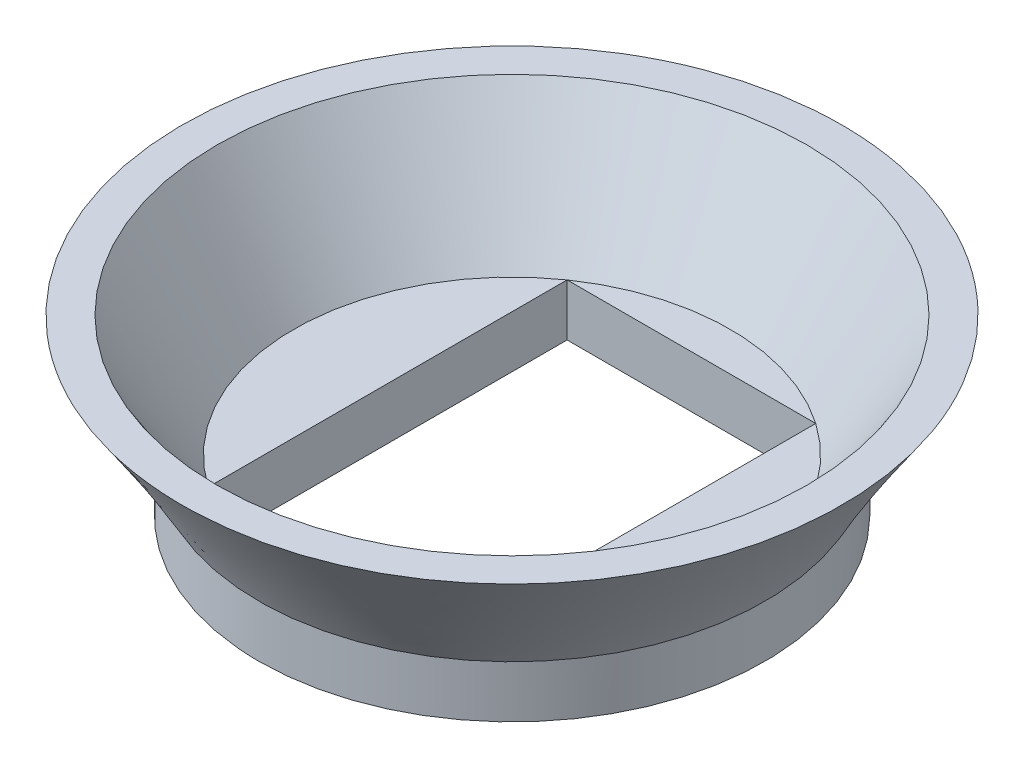
ISO-10303-21;
HEADER;
FILE_DESCRIPTION(('STEP AP214'),'2;1');
FILE_NAME('part.step','',(''),(''),'','','');
FILE_SCHEMA(('AUTOMOTIVE_DESIGN { 1 0 10303 214 1 1 1 1 }'));
ENDSEC;
DATA;
#1=APPLICATION_CONTEXT('core data for automotive mechanical design processes');
#2=APPLICATION_PROTOCOL_DEFINITION('international standard','automotive_design',2000,#1);
#3=PRODUCT_CONTEXT('',#1,'mechanical');
#4=PRODUCT('Part','Part','',(#3));
#5=PRODUCT_RELATED_PRODUCT_CATEGORY('part','',(#4));
#6=PRODUCT_DEFINITION_FORMATION('','',#4);
#7=PRODUCT_DEFINITION_CONTEXT('part definition',#1,'design');
#8=PRODUCT_DEFINITION('design','',#6,#7);
#9=PRODUCT_DEFINITION_SHAPE('','',#8);
#10=(LENGTH_UNIT() NAMED_UNIT(*) SI_UNIT(.MILLI.,.METRE.));
#11=(NAMED_UNIT(*) PLANE_ANGLE_UNIT() SI_UNIT($,.RADIAN.));
#12=(NAMED_UNIT(*) SI_UNIT($,.STERADIAN.) SOLID_ANGLE_UNIT());
#13=UNCERTAINTY_MEASURE_WITH_UNIT(LENGTH_MEASURE(1.E-05),#10,'distance_accuracy_value','');
#14=(GEOMETRIC_REPRESENTATION_CONTEXT(3) GLOBAL_UNCERTAINTY_ASSIGNED_CONTEXT((#13)) GLOBAL_UNIT_ASSIGNED_CONTEXT((#10,
#11,#12)) REPRESENTATION_CONTEXT('',''));
#15=CARTESIAN_POINT('',(0.,0.,0.));
#16=DIRECTION('',(0.,0.,1.));
#17=DIRECTION('',(1.,0.,0.));
#18=AXIS2_PLACEMENT_3D('',#15,#16,#17);
#19=CARTESIAN_POINT('',(0.,1.8,0.));
#20=DIRECTION('',(0.,1.,0.));
#21=DIRECTION('',(0.,0.,1.));
#22=AXIS2_PLACEMENT_3D('',#19,#20,#21);
#23=PLANE('',#22);
#24=DIRECTION('',(0.,0.,1.));
#25=VECTOR('',#24,1.);
#26=CARTESIAN_POINT('',(-4.3,1.8,-6.2058440199541));
#27=LINE('',#26,#25);
#28=CARTESIAN_POINT('',(-4.3,1.8,-6.2058440199541));
#29=VERTEX_POINT('',#28);
#30=CARTESIAN_POINT('',(-4.3,1.8,6.2058440199541));
#31=VERTEX_POINT('',#30);
#32=EDGE_CURVE('E98',#29,#31,#27,.T.);
#33=ORIENTED_EDGE('',*,*,#32,.F.);
#34=CARTESIAN_POINT('',(0.,1.8,0.));
#35=DIRECTION('',(0.,1.,0.));
#36=DIRECTION('',(0.,0.,1.));
#37=AXIS2_PLACEMENT_3D('',#34,#35,#36);
#38=CIRCLE('',#37,7.55);
#39=EDGE_CURVE('E140',#29,#31,#38,.T.);
#40=ORIENTED_EDGE('',*,*,#39,.T.);
#41=EDGE_LOOP('',(#33,#40));
#42=FACE_BOUND('',#41,.T.);
#43=ADVANCED_FACE('F47',(#42),#23,.T.);
#44=DIRECTION('',(1.,0.,0.));
#45=VECTOR('',#44,1.);
#46=CARTESIAN_POINT('',(4.3,1.8,6.2058440199541));
#47=LINE('',#46,#45);
#48=CARTESIAN_POINT('',(4.3,1.8,6.2058440199541));
#49=VERTEX_POINT('',#48);
#50=EDGE_CURVE('E134',#31,#49,#47,.T.);
#51=ORIENTED_EDGE('',*,*,#50,.F.);
#52=EDGE_CURVE('E157',#31,#49,#38,.T.);
#53=ORIENTED_EDGE('',*,*,#52,.T.);
#54=EDGE_LOOP('',(#51,#53));
#55=FACE_BOUND('',#54,.T.);
#56=ADVANCED_FACE('F265',(#55),#23,.T.);
#57=DIRECTION('',(0.,0.,-1.));
#58=VECTOR('',#57,1.);
#59=CARTESIAN_POINT('',(4.3,1.8,-6.2058440199541));
#60=LINE('',#59,#58);
#61=CARTESIAN_POINT('',(4.30000438472517,1.8,-6.20584279493454));
#62=VERTEX_POINT('',#61);
#63=EDGE_CURVE('E66',#49,#62,#60,.T.);
#64=ORIENTED_EDGE('',*,*,#63,.F.);
#65=EDGE_CURVE('E51',#49,#62,#38,.T.);
#66=ORIENTED_EDGE('',*,*,#65,.T.);
#67=EDGE_LOOP('',(#64,#66));
#68=FACE_BOUND('',#67,.T.);
#69=ADVANCED_FACE('F219',(#68),#23,.T.);
#70=CARTESIAN_POINT('',(0.,1.8,0.));
#71=DIRECTION('',(0.,-1.,0.));
#72=DIRECTION('',(0.,0.,-1.));
#73=AXIS2_PLACEMENT_3D('',#70,#71,#72);
#74=CYLINDRICAL_SURFACE('',#73,8.75);
#75=CARTESIAN_POINT('',(0.,1.8,0.));
#76=DIRECTION('',(0.,-1.,0.));
#77=DIRECTION('',(0.,0.,-1.));
#78=AXIS2_PLACEMENT_3D('',#75,#76,#77);
#79=CIRCLE('',#78,8.75);
#80=CARTESIAN_POINT('',(-0.757744304662549,1.8,8.7171281720961));
#81=VERTEX_POINT('',#80);
#82=EDGE_CURVE('E12',#81,#81,#79,.F.);
#83=ORIENTED_EDGE('',*,*,#82,.F.);
#84=EDGE_LOOP('',(#83));
#85=FACE_BOUND('',#84,.T.);
#86=CARTESIAN_POINT('',(0.,0.,0.));
#87=DIRECTION('',(0.,1.,0.));
#88=DIRECTION('',(0.,0.,1.));
#89=AXIS2_PLACEMENT_3D('',#86,#87,#88);
#90=CIRCLE('',#89,8.75);
#91=CARTESIAN_POINT('',(0.,0.,8.75));
#92=VERTEX_POINT('',#91);
#93=EDGE_CURVE('E58',#92,#92,#90,.T.);
#94=ORIENTED_EDGE('',*,*,#93,.T.);
#95=EDGE_LOOP('',(#94));
#96=FACE_BOUND('',#95,.T.);
#97=ADVANCED_FACE('F49',(#85,#96),#74,.T.);
#98=CARTESIAN_POINT('',(0.,0.,0.));
#99=DIRECTION('',(0.,1.,0.));
#100=DIRECTION('',(0.,0.,1.));
#101=AXIS2_PLACEMENT_3D('',#98,#99,#100);
#102=PLANE('',#101);
#103=DIRECTION('',(-1.,0.,0.));
#104=VECTOR('',#103,1.);
#105=CARTESIAN_POINT('',(4.3,0.,-6.2058440199541));
#106=LINE('',#105,#104);
#107=CARTESIAN_POINT('',(4.3,0.,-6.2058440199541));
#108=VERTEX_POINT('',#107);
#109=CARTESIAN_POINT('',(-4.3,0.,-6.2058440199541));
#110=VERTEX_POINT('',#109);
#111=EDGE_CURVE('E104',#108,#110,#106,.T.);
#112=ORIENTED_EDGE('',*,*,#111,.T.);
#113=DIRECTION('',(0.,0.,1.));
#114=VECTOR('',#113,1.);
#115=CARTESIAN_POINT('',(-4.3,0.,-6.2058440199541));
#116=LINE('',#115,#114);
#117=CARTESIAN_POINT('',(-4.3,0.,6.2058440199541));
#118=VERTEX_POINT('',#117);
#119=EDGE_CURVE('E95',#110,#118,#116,.T.);
#120=ORIENTED_EDGE('',*,*,#119,.T.);
#121=DIRECTION('',(1.,0.,0.));
#122=VECTOR('',#121,1.);
#123=CARTESIAN_POINT('',(4.3,0.,6.2058440199541));
#124=LINE('',#123,#122);
#125=CARTESIAN_POINT('',(4.3,0.,6.2058440199541));
#126=VERTEX_POINT('',#125);
#127=EDGE_CURVE('E107',#118,#126,#124,.T.);
#128=ORIENTED_EDGE('',*,*,#127,.T.);
#129=DIRECTION('',(0.,0.,-1.));
#130=VECTOR('',#129,1.);
#131=CARTESIAN_POINT('',(4.3,0.,-6.2058440199541));
#132=LINE('',#131,#130);
#133=EDGE_CURVE('E71',#126,#108,#132,.T.);
#134=ORIENTED_EDGE('',*,*,#133,.T.);
#135=EDGE_LOOP('',(#112,#120,#128,#134));
#136=FACE_BOUND('',#135,.T.);
#137=ORIENTED_EDGE('',*,*,#93,.F.);
#138=EDGE_LOOP('',(#137));
#139=FACE_BOUND('',#138,.T.);
#140=ADVANCED_FACE('F112',(#136,#139),#102,.F.);
#141=CARTESIAN_POINT('',(0.,6.,0.));
#142=DIRECTION('',(0.,1.,0.));
#143=DIRECTION('',(0.,0.,1.));
#144=AXIS2_PLACEMENT_3D('',#141,#142,#143);
#145=PLANE('',#144);
#146=CARTESIAN_POINT('',(0.,6.,0.));
#147=DIRECTION('',(0.,1.,0.));
#148=DIRECTION('',(0.,0.,1.));
#149=AXIS2_PLACEMENT_3D('',#146,#147,#148);
#150=CIRCLE('',#149,10.2);
#151=CARTESIAN_POINT('',(0.,6.,10.2));
#152=VERTEX_POINT('',#151);
#153=EDGE_CURVE('E149',#152,#152,#150,.T.);
#154=ORIENTED_EDGE('',*,*,#153,.F.);
#155=EDGE_LOOP('',(#154));
#156=FACE_BOUND('',#155,.T.);
#157=CARTESIAN_POINT('',(0.,6.,0.));
#158=DIRECTION('',(0.,1.,0.));
#159=DIRECTION('',(0.,0.,1.));
#160=AXIS2_PLACEMENT_3D('',#157,#158,#159);
#161=CIRCLE('',#160,11.4);
#162=CARTESIAN_POINT('',(-3.81439950139794,6.,10.7429212248687));
#163=VERTEX_POINT('',#162);
#164=EDGE_CURVE('E222',#163,#163,#161,.T.);
#165=ORIENTED_EDGE('',*,*,#164,.T.);
#166=EDGE_LOOP('',(#165));
#167=FACE_BOUND('',#166,.T.);
#168=ADVANCED_FACE('F248',(#156,#167),#145,.T.);
#169=CARTESIAN_POINT('',(-0.757744304662549,1.8,8.7171281720961));
#170=CARTESIAN_POINT('',(-3.81439950139794,6.,10.7429212248687));
#171=CARTESIAN_POINT('',(16.6765120395296,1.8,10.2326167814212));
#172=CARTESIAN_POINT('',(17.6714429483395,6.,18.3717202276646));
#173=CARTESIAN_POINT('',(18.1920006488547,1.8,-7.20163956277101));
#174=CARTESIAN_POINT('',(25.3002419511354,6.,-3.11412222207286));
#175=CARTESIAN_POINT('',(0.757744304662548,1.8,-8.7171281720961));
#176=CARTESIAN_POINT('',(3.81439950139794,6.,-10.7429212248687));
#177=CARTESIAN_POINT('',(-16.6765120395297,1.8,-10.2326167814212));
#178=CARTESIAN_POINT('',(-17.6714429483395,6.,-18.3717202276646));
#179=CARTESIAN_POINT('',(-18.1920006488547,1.8,7.201639562771));
#180=CARTESIAN_POINT('',(-25.3002419511354,6.,3.11412222207286));
#181=CARTESIAN_POINT('',(-0.757744304662549,1.8,8.7171281720961));
#182=CARTESIAN_POINT('',(-3.81439950139794,6.,10.7429212248687));
#183=(BOUNDED_SURFACE() B_SPLINE_SURFACE(3,1,((#169,#170),(#171,#172),(#173,#174),(#175,#176),
(#177,#178),(#179,#180),(#181,#182)),.UNSPECIFIED.,.T.,.F.,.F.) B_SPLINE_SURFACE_WITH_KNOTS((4,
3,4),(2,2),(0.,0.5,1.),(0.,1.),
.UNSPECIFIED.) GEOMETRIC_REPRESENTATION_ITEM() RATIONAL_B_SPLINE_SURFACE(((1.,1.),
(0.333333333333333,0.333333333333333),(0.333333333333333,0.333333333333333),(1.,1.),
(0.333333333333333,0.333333333333333),(0.333333333333333,0.333333333333333),(1.,1.))) REPRESENTATION_ITEM('') SURFACE());
#184=CARTESIAN_POINT('',(-0.757744304662549,1.8,8.7171281720961));
#185=CARTESIAN_POINT('',(-0.789584462961875,1.84375,8.73823018306249));
#186=CARTESIAN_POINT('',(-0.821424621261202,1.8875,8.75933219402887));
#187=CARTESIAN_POINT('',(-0.885104937859857,1.975,8.80153621596163));
#188=CARTESIAN_POINT('',(-0.916945096159184,2.01875,8.82263822692801));
#189=CARTESIAN_POINT('',(-0.980625412757838,2.10625,8.86484224886077));
#190=CARTESIAN_POINT('',(-1.01246557105716,2.15,8.88594425982715));
#191=CARTESIAN_POINT('',(-1.07614588765582,2.2375,8.92814828175992));
#192=CARTESIAN_POINT('',(-1.10798604595515,2.28125,8.9492502927263));
#193=CARTESIAN_POINT('',(-1.1716663625538,2.36875,8.99145431465906));
#194=CARTESIAN_POINT('',(-1.20350652085313,2.4125,9.01255632562544));
#195=CARTESIAN_POINT('',(-1.26718683745178,2.5,9.0547603475582));
#196=CARTESIAN_POINT('',(-1.29902699575111,2.54375,9.07586235852459));
#197=CARTESIAN_POINT('',(-1.36270731234976,2.63125,9.11806638045735));
#198=CARTESIAN_POINT('',(-1.39454747064909,2.675,9.13916839142373));
#199=CARTESIAN_POINT('',(-1.45822778724774,2.7625,9.1813724133565));
#200=CARTESIAN_POINT('',(-1.49006794554707,2.80625,9.20247442432288));
#201=CARTESIAN_POINT('',(-1.55374826214572,2.89375,9.24467844625564));
#202=CARTESIAN_POINT('',(-1.58558842044505,2.9375,9.26578045722202));
#203=CARTESIAN_POINT('',(-1.6492687370437,3.025,9.30798447915478));
#204=CARTESIAN_POINT('',(-1.68110889534303,3.06875,9.32908649012117));
#205=CARTESIAN_POINT('',(-1.74478921194169,3.15625,9.37129051205393));
#206=CARTESIAN_POINT('',(-1.77662937024101,3.2,9.39239252302031));
#207=CARTESIAN_POINT('',(-1.84030968683967,3.2875,9.43459654495307));
#208=CARTESIAN_POINT('',(-1.87214984513899,3.33125,9.45569855591946));
#209=CARTESIAN_POINT('',(-1.93583016173765,3.41875,9.49790257785222));
#210=CARTESIAN_POINT('',(-1.96767032003697,3.4625,9.5190045888186));
#211=CARTESIAN_POINT('',(-2.03135063663563,3.55,9.56120861075136));
#212=CARTESIAN_POINT('',(-2.06319079493495,3.59375,9.58231062171775));
#213=CARTESIAN_POINT('',(-2.12687111153361,3.68125,9.62451464365051));
#214=CARTESIAN_POINT('',(-2.15871126983294,3.725,9.64561665461689));
#215=CARTESIAN_POINT('',(-2.22239158643159,3.8125,9.68782067654965));
#216=CARTESIAN_POINT('',(-2.25423174473092,3.85625,9.70892268751604));
#217=CARTESIAN_POINT('',(-2.31791206132957,3.94375,9.7511267094488));
#218=CARTESIAN_POINT('',(-2.3497522196289,3.9875,9.77222872041518));
#219=CARTESIAN_POINT('',(-2.41343253622755,4.075,9.81443274234794));
#220=CARTESIAN_POINT('',(-2.44527269452688,4.11875,9.83553475331433));
#221=CARTESIAN_POINT('',(-2.50895301112553,4.20625,9.87773877524709));
#222=CARTESIAN_POINT('',(-2.54079316942486,4.25,9.89884078621347));
#223=CARTESIAN_POINT('',(-2.60447348602351,4.3375,9.94104480814623));
#224=CARTESIAN_POINT('',(-2.63631364432284,4.38125,9.96214681911261));
#225=CARTESIAN_POINT('',(-2.69999396092149,4.46875,10.0043508410454));
#226=CARTESIAN_POINT('',(-2.73183411922082,4.5125,10.0254528520118));
#227=CARTESIAN_POINT('',(-2.79551443581948,4.6,10.0676568739445));
#228=CARTESIAN_POINT('',(-2.8273545941188,4.64375,10.0887588849109));
#229=CARTESIAN_POINT('',(-2.89103491071746,4.73125,10.1309629068437));
#230=CARTESIAN_POINT('',(-2.92287506901678,4.775,10.1520649178101));
#231=CARTESIAN_POINT('',(-2.98655538561544,4.8625,10.1942689397428));
#232=CARTESIAN_POINT('',(-3.01839554391476,4.90625,10.2153709507092));
#233=CARTESIAN_POINT('',(-3.08207586051342,4.99375,10.257574972642));
#234=CARTESIAN_POINT('',(-3.11391601881275,5.0375,10.2786769836083));
#235=CARTESIAN_POINT('',(-3.1775963354114,5.125,10.3208810055411));
#236=CARTESIAN_POINT('',(-3.20943649371073,5.16875,10.3419830165075));
#237=CARTESIAN_POINT('',(-3.27311681030938,5.25625,10.3841870384402));
#238=CARTESIAN_POINT('',(-3.30495696860871,5.3,10.4052890494066));
#239=CARTESIAN_POINT('',(-3.36863728520736,5.3875,10.4474930713394));
#240=CARTESIAN_POINT('',(-3.40047744350669,5.43125,10.4685950823058));
#241=CARTESIAN_POINT('',(-3.46415776010534,5.51875,10.5107991042385));
#242=CARTESIAN_POINT('',(-3.49599791840467,5.5625,10.5319011152049));
#243=CARTESIAN_POINT('',(-3.55967823500332,5.65,10.5741051371377));
#244=CARTESIAN_POINT('',(-3.59151839330265,5.69375,10.5952071481041));
#245=CARTESIAN_POINT('',(-3.6551987099013,5.78125,10.6374111700368));
#246=CARTESIAN_POINT('',(-3.68703886820063,5.825,10.6585131810032));
#247=CARTESIAN_POINT('',(-3.75071918479929,5.9125,10.700717202936));
#248=CARTESIAN_POINT('',(-3.78255934309861,5.95625,10.7218192139024));
#249=CARTESIAN_POINT('',(-3.81439950139794,6.,10.7429212248687));
#250=B_SPLINE_CURVE_WITH_KNOTS('',3,(#184,#185,#186,#187,#188,#189,#190,#191,#192,#193,#194,
#195,#196,#197,#198,#199,#200,#201,#202,#203,#204,#205,#206,#207,#208,#209,#210,#211,#212,#213,
#214,#215,#216,#217,#218,#219,#220,#221,#222,#223,#224,#225,#226,#227,#228,#229,#230,#231,#232,
#233,#234,#235,#236,#237,#238,#239,#240,#241,#242,#243,#244,#245,#246,#247,#248,#249),
.UNSPECIFIED.,.F.,.F.,(4,2,2,2,2,2,2,2,2,2,2,2,2,2,2,2,2,2,2,2,2,2,2,2,2,2,2,2,2,2,2,2,4),(0.,
0.174236555940949,0.348473111881898,0.522709667822847,0.696946223763795,0.871182779704744,
1.04541933564569,1.21965589158664,1.39389244752759,1.56812900346854,1.74236555940949,
1.91660211535044,2.09083867129139,2.26507522723234,2.43931178317328,2.61354833911423,
2.78778489505518,2.96202145099613,3.13625800693708,3.31049456287803,3.48473111881898,
3.65896767475993,3.83320423070088,4.00744078664183,4.18167734258277,4.35591389852372,
4.53015045446467,4.70438701040562,4.87862356634657,5.05286012228752,5.22709667822847,
5.40133323416942,5.57556979011037),.UNSPECIFIED.);
#251=EDGE_CURVE('BSEAM205',#81,#163,#250,.T.);
#252=ORIENTED_EDGE('',*,*,#82,.T.);
#253=ORIENTED_EDGE('',*,*,#164,.F.);
#254=ORIENTED_EDGE('',*,*,#251,.T.);
#255=ORIENTED_EDGE('',*,*,#251,.F.);
#256=EDGE_LOOP('',(#252,#254,#253,#255));
#257=FACE_BOUND('',#256,.T.);
#258=ADVANCED_FACE('F205',(#257),#183,.T.);
#259=DIRECTION('',(-1.,0.,0.));
#260=VECTOR('',#259,1.);
#261=CARTESIAN_POINT('',(4.3,1.8,-6.2058440199541));
#262=LINE('',#261,#260);
#263=EDGE_CURVE('E116',#62,#29,#262,.T.);
#264=ORIENTED_EDGE('',*,*,#263,.F.);
#265=EDGE_CURVE('E137',#62,#29,#38,.T.);
#266=ORIENTED_EDGE('',*,*,#265,.T.);
#267=EDGE_LOOP('',(#264,#266));
#268=FACE_BOUND('',#267,.T.);
#269=ADVANCED_FACE('F202',(#268),#23,.T.);
#270=CARTESIAN_POINT('',(0.,1.8,0.));
#271=DIRECTION('',(0.,1.,0.));
#272=DIRECTION('',(0.,0.,1.));
#273=AXIS2_PLACEMENT_3D('',#270,#271,#272);
#274=CONICAL_SURFACE('',#273,7.55,0.56286823284811);
#275=ORIENTED_EDGE('',*,*,#65,.F.);
#276=ORIENTED_EDGE('',*,*,#52,.F.);
#277=ORIENTED_EDGE('',*,*,#39,.F.);
#278=ORIENTED_EDGE('',*,*,#265,.F.);
#279=EDGE_LOOP('',(#275,#276,#277,#278));
#280=FACE_BOUND('',#279,.T.);
#281=ORIENTED_EDGE('',*,*,#153,.T.);
#282=EDGE_LOOP('',(#281));
#283=FACE_BOUND('',#282,.T.);
#284=ADVANCED_FACE('F193',(#280,#283),#274,.F.);
#285=CARTESIAN_POINT('',(-4.3,0.,-6.2058440199541));
#286=DIRECTION('',(-1.,0.,0.));
#287=DIRECTION('',(0.,0.,1.));
#288=AXIS2_PLACEMENT_3D('',#285,#286,#287);
#289=PLANE('',#288);
#290=ORIENTED_EDGE('',*,*,#32,.T.);
#291=DIRECTION('',(0.,1.,0.));
#292=VECTOR('',#291,1.);
#293=CARTESIAN_POINT('',(-4.3,0.,6.2058440199541));
#294=LINE('',#293,#292);
#295=EDGE_CURVE('E91',#118,#31,#294,.T.);
#296=ORIENTED_EDGE('',*,*,#295,.F.);
#297=ORIENTED_EDGE('',*,*,#119,.F.);
#298=DIRECTION('',(0.,1.,0.));
#299=VECTOR('',#298,1.);
#300=CARTESIAN_POINT('',(-4.3,0.,-6.2058440199541));
#301=LINE('',#300,#299);
#302=EDGE_CURVE('E161',#110,#29,#301,.T.);
#303=ORIENTED_EDGE('',*,*,#302,.T.);
#304=EDGE_LOOP('',(#290,#296,#297,#303));
#305=FACE_BOUND('',#304,.T.);
#306=ADVANCED_FACE('F93',(#305),#289,.F.);
#307=CARTESIAN_POINT('',(4.3,0.,-6.2058440199541));
#308=DIRECTION('',(0.,0.,-1.));
#309=DIRECTION('',(-1.,0.,0.));
#310=AXIS2_PLACEMENT_3D('',#307,#308,#309);
#311=PLANE('',#310);
#312=ORIENTED_EDGE('',*,*,#263,.T.);
#313=ORIENTED_EDGE('',*,*,#302,.F.);
#314=ORIENTED_EDGE('',*,*,#111,.F.);
#315=DIRECTION('',(0.,1.,0.));
#316=VECTOR('',#315,1.);
#317=CARTESIAN_POINT('',(4.3,0.,-6.2058440199541));
#318=LINE('',#317,#316);
#319=EDGE_CURVE('E164',#108,#62,#318,.T.);
#320=ORIENTED_EDGE('',*,*,#319,.T.);
#321=EDGE_LOOP('',(#312,#313,#314,#320));
#322=FACE_BOUND('',#321,.T.);
#323=ADVANCED_FACE('F302',(#322),#311,.F.);
#324=CARTESIAN_POINT('',(4.3,0.,-6.2058440199541));
#325=DIRECTION('',(1.,0.,0.));
#326=DIRECTION('',(0.,0.,-1.));
#327=AXIS2_PLACEMENT_3D('',#324,#325,#326);
#328=PLANE('',#327);
#329=ORIENTED_EDGE('',*,*,#63,.T.);
#330=ORIENTED_EDGE('',*,*,#319,.F.);
#331=ORIENTED_EDGE('',*,*,#133,.F.);
#332=DIRECTION('',(0.,1.,0.));
#333=VECTOR('',#332,1.);
#334=CARTESIAN_POINT('',(4.3,0.,6.2058440199541));
#335=LINE('',#334,#333);
#336=EDGE_CURVE('E103',#126,#49,#335,.T.);
#337=ORIENTED_EDGE('',*,*,#336,.T.);
#338=EDGE_LOOP('',(#329,#330,#331,#337));
#339=FACE_BOUND('',#338,.T.);
#340=ADVANCED_FACE('F307',(#339),#328,.F.);
#341=CARTESIAN_POINT('',(4.3,0.,6.2058440199541));
#342=DIRECTION('',(0.,0.,1.));
#343=DIRECTION('',(1.,0.,0.));
#344=AXIS2_PLACEMENT_3D('',#341,#342,#343);
#345=PLANE('',#344);
#346=ORIENTED_EDGE('',*,*,#50,.T.);
#347=ORIENTED_EDGE('',*,*,#336,.F.);
#348=ORIENTED_EDGE('',*,*,#127,.F.);
#349=ORIENTED_EDGE('',*,*,#295,.T.);
#350=EDGE_LOOP('',(#346,#347,#348,#349));
#351=FACE_BOUND('',#350,.T.);
#352=ADVANCED_FACE('F108',(#351),#345,.F.);
#353=CLOSED_SHELL('',(#43,#56,#69,#97,#140,#168,#258,#269,#284,#306,#323,#340,#352));
#354=MANIFOLD_SOLID_BREP('B2',#353);
#355=ADVANCED_BREP_SHAPE_REPRESENTATION('',(#18,#354),#14);
#356=SHAPE_DEFINITION_REPRESENTATION(#9,#355);
ENDSEC;
END-ISO-10303-21;
